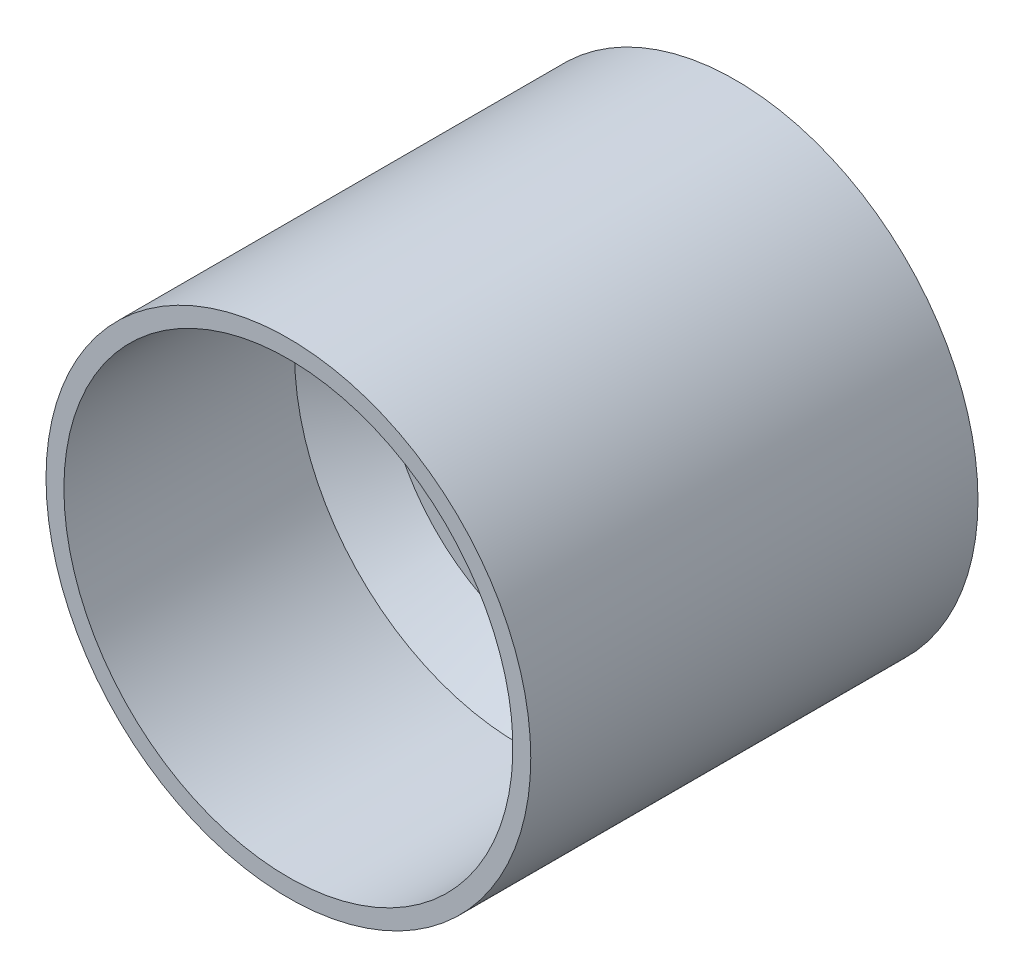
ISO-10303-21;
HEADER;
FILE_DESCRIPTION(('STEP AP214'),'2;1');
FILE_NAME('part.step','',(''),(''),'','','');
FILE_SCHEMA(('AUTOMOTIVE_DESIGN { 1 0 10303 214 1 1 1 1 }'));
ENDSEC;
DATA;
#1=APPLICATION_CONTEXT('core data for automotive mechanical design processes');
#2=APPLICATION_PROTOCOL_DEFINITION('international standard','automotive_design',2000,#1);
#3=PRODUCT_CONTEXT('',#1,'mechanical');
#4=PRODUCT('Part','Part','',(#3));
#5=PRODUCT_RELATED_PRODUCT_CATEGORY('part','',(#4));
#6=PRODUCT_DEFINITION_FORMATION('','',#4);
#7=PRODUCT_DEFINITION_CONTEXT('part definition',#1,'design');
#8=PRODUCT_DEFINITION('design','',#6,#7);
#9=PRODUCT_DEFINITION_SHAPE('','',#8);
#10=(LENGTH_UNIT() NAMED_UNIT(*) SI_UNIT(.MILLI.,.METRE.));
#11=(NAMED_UNIT(*) PLANE_ANGLE_UNIT() SI_UNIT($,.RADIAN.));
#12=(NAMED_UNIT(*) SI_UNIT($,.STERADIAN.) SOLID_ANGLE_UNIT());
#13=UNCERTAINTY_MEASURE_WITH_UNIT(LENGTH_MEASURE(1.E-05),#10,'distance_accuracy_value','');
#14=(GEOMETRIC_REPRESENTATION_CONTEXT(3) GLOBAL_UNCERTAINTY_ASSIGNED_CONTEXT((#13)) GLOBAL_UNIT_ASSIGNED_CONTEXT((#10,
#11,#12)) REPRESENTATION_CONTEXT('',''));
#15=CARTESIAN_POINT('',(0.,0.,0.));
#16=DIRECTION('',(0.,0.,1.));
#17=DIRECTION('',(1.,0.,0.));
#18=AXIS2_PLACEMENT_3D('',#15,#16,#17);
#19=CARTESIAN_POINT('',(25.1,0.,-10.3));
#20=DIRECTION('',(0.,0.,1.));
#21=DIRECTION('',(1.,0.,0.));
#22=AXIS2_PLACEMENT_3D('',#19,#20,#21);
#23=PLANE('',#22);
#24=CARTESIAN_POINT('',(0.,0.,-10.3));
#25=DIRECTION('',(0.,0.,1.));
#26=DIRECTION('',(1.,0.,0.));
#27=AXIS2_PLACEMENT_3D('',#24,#25,#26);
#28=CIRCLE('',#27,20.1);
#29=CARTESIAN_POINT('',(20.1,0.,-10.3));
#30=VERTEX_POINT('',#29);
#31=EDGE_CURVE('E203',#30,#30,#28,.F.);
#32=ORIENTED_EDGE('',*,*,#31,.T.);
#33=EDGE_LOOP('',(#32));
#34=FACE_BOUND('',#33,.T.);
#35=CARTESIAN_POINT('',(0.,-12.5,-10.3));
#36=DIRECTION('',(0.,0.,-1.));
#37=DIRECTION('',(-1.,0.,0.));
#38=AXIS2_PLACEMENT_3D('',#35,#36,#37);
#39=CIRCLE('',#38,1.5);
#40=CARTESIAN_POINT('',(-1.50000000000001,-12.5,-10.3));
#41=VERTEX_POINT('',#40);
#42=EDGE_CURVE('E457',#41,#41,#39,.T.);
#43=ORIENTED_EDGE('',*,*,#42,.F.);
#44=EDGE_LOOP('',(#43));
#45=FACE_BOUND('',#44,.T.);
#46=CARTESIAN_POINT('',(0.,12.5,-10.3));
#47=DIRECTION('',(0.,0.,-1.));
#48=DIRECTION('',(-1.,0.,0.));
#49=AXIS2_PLACEMENT_3D('',#46,#47,#48);
#50=CIRCLE('',#49,1.5);
#51=CARTESIAN_POINT('',(-1.5,12.5,-10.3));
#52=VERTEX_POINT('',#51);
#53=EDGE_CURVE('E465',#52,#52,#50,.T.);
#54=ORIENTED_EDGE('',*,*,#53,.F.);
#55=EDGE_LOOP('',(#54));
#56=FACE_BOUND('',#55,.T.);
#57=CARTESIAN_POINT('',(6.36396103067893,-6.36396103067893,-10.3));
#58=DIRECTION('',(0.,0.,-1.));
#59=DIRECTION('',(-1.,0.,0.));
#60=AXIS2_PLACEMENT_3D('',#57,#58,#59);
#61=CIRCLE('',#60,1.09999999999997);
#62=CARTESIAN_POINT('',(5.26396103067896,-6.36396103067893,-10.3));
#63=VERTEX_POINT('',#62);
#64=EDGE_CURVE('E462',#63,#63,#61,.T.);
#65=ORIENTED_EDGE('',*,*,#64,.F.);
#66=EDGE_LOOP('',(#65));
#67=FACE_BOUND('',#66,.T.);
#68=CARTESIAN_POINT('',(-6.36396103067893,-6.36396103067893,-10.3));
#69=DIRECTION('',(0.,0.,-1.));
#70=DIRECTION('',(-1.,0.,0.));
#71=AXIS2_PLACEMENT_3D('',#68,#69,#70);
#72=CIRCLE('',#71,1.09999999999994);
#73=CARTESIAN_POINT('',(-7.46396103067887,-6.36396103067893,-10.3));
#74=VERTEX_POINT('',#73);
#75=EDGE_CURVE('E454',#74,#74,#72,.T.);
#76=ORIENTED_EDGE('',*,*,#75,.F.);
#77=EDGE_LOOP('',(#76));
#78=FACE_BOUND('',#77,.T.);
#79=CARTESIAN_POINT('',(-6.36396103067893,6.36396103067893,-10.3));
#80=DIRECTION('',(0.,0.,-1.));
#81=DIRECTION('',(-1.,0.,0.));
#82=AXIS2_PLACEMENT_3D('',#79,#80,#81);
#83=CIRCLE('',#82,1.10000000000003);
#84=CARTESIAN_POINT('',(-7.46396103067896,6.36396103067893,-10.3));
#85=VERTEX_POINT('',#84);
#86=EDGE_CURVE('E450',#85,#85,#83,.T.);
#87=ORIENTED_EDGE('',*,*,#86,.F.);
#88=EDGE_LOOP('',(#87));
#89=FACE_BOUND('',#88,.T.);
#90=CARTESIAN_POINT('',(6.36396103067893,6.36396103067893,-10.3));
#91=DIRECTION('',(0.,0.,-1.));
#92=DIRECTION('',(-1.,0.,0.));
#93=AXIS2_PLACEMENT_3D('',#90,#91,#92);
#94=CIRCLE('',#93,1.10000000000006);
#95=CARTESIAN_POINT('',(5.26396103067887,6.36396103067893,-10.3));
#96=VERTEX_POINT('',#95);
#97=EDGE_CURVE('E106',#96,#96,#94,.T.);
#98=ORIENTED_EDGE('',*,*,#97,.F.);
#99=EDGE_LOOP('',(#98));
#100=FACE_BOUND('',#99,.T.);
#101=CARTESIAN_POINT('',(0.,0.,-10.3));
#102=DIRECTION('',(0.,0.,-1.));
#103=DIRECTION('',(-1.,0.,0.));
#104=AXIS2_PLACEMENT_3D('',#101,#102,#103);
#105=CIRCLE('',#104,7.05);
#106=CARTESIAN_POINT('',(-6.05,3.61939221417077,-10.3));
#107=VERTEX_POINT('',#106);
#108=CARTESIAN_POINT('',(6.05,3.61939221417077,-10.3));
#109=VERTEX_POINT('',#108);
#110=EDGE_CURVE('E98',#107,#109,#105,.T.);
#111=ORIENTED_EDGE('',*,*,#110,.F.);
#112=DIRECTION('',(0.,1.,0.));
#113=VECTOR('',#112,1.);
#114=CARTESIAN_POINT('',(-6.05,-3.61939221417077,-10.3));
#115=LINE('',#114,#113);
#116=CARTESIAN_POINT('',(-6.05,-3.61939221417077,-10.3));
#117=VERTEX_POINT('',#116);
#118=EDGE_CURVE('E95',#117,#107,#115,.T.);
#119=ORIENTED_EDGE('',*,*,#118,.F.);
#120=CARTESIAN_POINT('',(0.,0.,-10.3));
#121=DIRECTION('',(0.,0.,-1.));
#122=DIRECTION('',(-1.,0.,0.));
#123=AXIS2_PLACEMENT_3D('',#120,#121,#122);
#124=CIRCLE('',#123,7.05);
#125=CARTESIAN_POINT('',(6.05,-3.61939221417077,-10.3));
#126=VERTEX_POINT('',#125);
#127=EDGE_CURVE('E68',#126,#117,#124,.T.);
#128=ORIENTED_EDGE('',*,*,#127,.F.);
#129=DIRECTION('',(0.,-1.,0.));
#130=VECTOR('',#129,1.);
#131=CARTESIAN_POINT('',(6.05,3.61939221417077,-10.3));
#132=LINE('',#131,#130);
#133=EDGE_CURVE('E90',#109,#126,#132,.T.);
#134=ORIENTED_EDGE('',*,*,#133,.F.);
#135=EDGE_LOOP('',(#111,#119,#128,#134));
#136=FACE_BOUND('',#135,.T.);
#137=ADVANCED_FACE('F44',(#34,#45,#56,#67,#78,#89,#100,#136),#23,.F.);
#138=CARTESIAN_POINT('',(0.,0.,-51.2881578947369));
#139=DIRECTION('',(0.,0.,-1.));
#140=DIRECTION('',(-1.,0.,0.));
#141=AXIS2_PLACEMENT_3D('',#138,#139,#140);
#142=CYLINDRICAL_SURFACE('',#141,25.1);
#143=CARTESIAN_POINT('',(0.,0.,-15.3));
#144=DIRECTION('',(0.,0.,1.));
#145=DIRECTION('',(1.,0.,0.));
#146=AXIS2_PLACEMENT_3D('',#143,#144,#145);
#147=CIRCLE('',#146,25.1);
#148=CARTESIAN_POINT('',(25.1,0.,-15.3));
#149=VERTEX_POINT('',#148);
#150=EDGE_CURVE('E207',#149,#149,#147,.T.);
#151=ORIENTED_EDGE('',*,*,#150,.T.);
#152=EDGE_LOOP('',(#151));
#153=FACE_BOUND('',#152,.T.);
#154=CARTESIAN_POINT('',(0.,0.,-23.5));
#155=DIRECTION('',(0.,0.,-1.));
#156=DIRECTION('',(-1.,0.,0.));
#157=AXIS2_PLACEMENT_3D('',#154,#155,#156);
#158=CIRCLE('',#157,25.1);
#159=CARTESIAN_POINT('',(-25.1,0.,-23.5));
#160=VERTEX_POINT('',#159);
#161=EDGE_CURVE('E173',#160,#160,#158,.T.);
#162=ORIENTED_EDGE('',*,*,#161,.T.);
#163=EDGE_LOOP('',(#162));
#164=FACE_BOUND('',#163,.T.);
#165=ADVANCED_FACE('F233',(#153,#164),#142,.F.);
#166=CARTESIAN_POINT('',(0.,0.,-2.3));
#167=DIRECTION('',(0.,0.,-1.));
#168=DIRECTION('',(-1.,0.,0.));
#169=AXIS2_PLACEMENT_3D('',#166,#167,#168);
#170=CIRCLE('',#169,25.1);
#171=CARTESIAN_POINT('',(-25.1,0.,-2.3));
#172=VERTEX_POINT('',#171);
#173=EDGE_CURVE('E199',#172,#172,#170,.T.);
#174=ORIENTED_EDGE('',*,*,#173,.T.);
#175=EDGE_LOOP('',(#174));
#176=FACE_BOUND('',#175,.T.);
#177=CARTESIAN_POINT('',(0.,0.,23.5));
#178=DIRECTION('',(0.,0.,-1.));
#179=DIRECTION('',(-1.,0.,0.));
#180=AXIS2_PLACEMENT_3D('',#177,#178,#179);
#181=CIRCLE('',#180,25.1);
#182=CARTESIAN_POINT('',(-25.1,0.,23.5));
#183=VERTEX_POINT('',#182);
#184=EDGE_CURVE('E169',#183,#183,#181,.T.);
#185=ORIENTED_EDGE('',*,*,#184,.F.);
#186=EDGE_LOOP('',(#185));
#187=FACE_BOUND('',#186,.T.);
#188=ADVANCED_FACE('F239',(#176,#187),#142,.F.);
#189=CARTESIAN_POINT('',(27.1,0.,-26.5));
#190=DIRECTION('',(0.,0.,1.));
#191=DIRECTION('',(1.,0.,0.));
#192=AXIS2_PLACEMENT_3D('',#189,#190,#191);
#193=PLANE('',#192);
#194=CARTESIAN_POINT('',(0.,20.25,-26.5));
#195=DIRECTION('',(0.,0.,-1.));
#196=DIRECTION('',(-1.,0.,0.));
#197=AXIS2_PLACEMENT_3D('',#194,#195,#196);
#198=CIRCLE('',#197,2.);
#199=CARTESIAN_POINT('',(-2.,20.25,-26.5));
#200=VERTEX_POINT('',#199);
#201=EDGE_CURVE('E148',#200,#200,#198,.T.);
#202=ORIENTED_EDGE('',*,*,#201,.F.);
#203=EDGE_LOOP('',(#202));
#204=FACE_BOUND('',#203,.T.);
#205=CARTESIAN_POINT('',(17.5370144266349,-10.125,-26.5));
#206=DIRECTION('',(0.,0.,-1.));
#207=DIRECTION('',(-1.,0.,0.));
#208=AXIS2_PLACEMENT_3D('',#205,#206,#207);
#209=CIRCLE('',#208,2.);
#210=CARTESIAN_POINT('',(15.5370144266349,-10.125,-26.5));
#211=VERTEX_POINT('',#210);
#212=EDGE_CURVE('E153',#211,#211,#209,.T.);
#213=ORIENTED_EDGE('',*,*,#212,.F.);
#214=EDGE_LOOP('',(#213));
#215=FACE_BOUND('',#214,.T.);
#216=CARTESIAN_POINT('',(-17.5370144266349,-10.125,-26.5));
#217=DIRECTION('',(0.,0.,-1.));
#218=DIRECTION('',(-1.,0.,0.));
#219=AXIS2_PLACEMENT_3D('',#216,#217,#218);
#220=CIRCLE('',#219,2.);
#221=CARTESIAN_POINT('',(-19.5370144266349,-10.125,-26.5));
#222=VERTEX_POINT('',#221);
#223=EDGE_CURVE('E147',#222,#222,#220,.T.);
#224=ORIENTED_EDGE('',*,*,#223,.F.);
#225=EDGE_LOOP('',(#224));
#226=FACE_BOUND('',#225,.T.);
#227=CARTESIAN_POINT('',(0.,0.,-26.5));
#228=DIRECTION('',(0.,0.,-1.));
#229=DIRECTION('',(-1.,0.,0.));
#230=AXIS2_PLACEMENT_3D('',#227,#228,#229);
#231=CIRCLE('',#230,15.25);
#232=CARTESIAN_POINT('',(-15.25,0.,-26.5));
#233=VERTEX_POINT('',#232);
#234=EDGE_CURVE('E181',#233,#233,#231,.T.);
#235=ORIENTED_EDGE('',*,*,#234,.F.);
#236=EDGE_LOOP('',(#235));
#237=FACE_BOUND('',#236,.T.);
#238=CARTESIAN_POINT('',(0.,0.,-26.5));
#239=DIRECTION('',(0.,0.,-1.));
#240=DIRECTION('',(-1.,0.,0.));
#241=AXIS2_PLACEMENT_3D('',#238,#239,#240);
#242=CIRCLE('',#241,27.1);
#243=CARTESIAN_POINT('',(-27.1,0.,-26.5));
#244=VERTEX_POINT('',#243);
#245=EDGE_CURVE('E160',#244,#244,#242,.T.);
#246=ORIENTED_EDGE('',*,*,#245,.T.);
#247=EDGE_LOOP('',(#246));
#248=FACE_BOUND('',#247,.T.);
#249=ADVANCED_FACE('F273',(#204,#215,#226,#237,#248),#193,.F.);
#250=CARTESIAN_POINT('',(0.,0.,-51.2881578947369));
#251=DIRECTION('',(0.,0.,-1.));
#252=DIRECTION('',(-1.,0.,0.));
#253=AXIS2_PLACEMENT_3D('',#250,#251,#252);
#254=CYLINDRICAL_SURFACE('',#253,15.25);
#255=CARTESIAN_POINT('',(0.,0.,-23.5));
#256=DIRECTION('',(0.,0.,-1.));
#257=DIRECTION('',(-1.,0.,0.));
#258=AXIS2_PLACEMENT_3D('',#255,#256,#257);
#259=CIRCLE('',#258,15.25);
#260=CARTESIAN_POINT('',(-15.25,0.,-23.5));
#261=VERTEX_POINT('',#260);
#262=EDGE_CURVE('E177',#261,#261,#259,.T.);
#263=ORIENTED_EDGE('',*,*,#262,.F.);
#264=EDGE_LOOP('',(#263));
#265=FACE_BOUND('',#264,.T.);
#266=ORIENTED_EDGE('',*,*,#234,.T.);
#267=EDGE_LOOP('',(#266));
#268=FACE_BOUND('',#267,.T.);
#269=ADVANCED_FACE('F269',(#265,#268),#254,.F.);
#270=CARTESIAN_POINT('',(15.25,0.,-23.5));
#271=DIRECTION('',(0.,0.,-1.));
#272=DIRECTION('',(-1.,0.,0.));
#273=AXIS2_PLACEMENT_3D('',#270,#271,#272);
#274=PLANE('',#273);
#275=CARTESIAN_POINT('',(0.,20.25,-23.5));
#276=DIRECTION('',(0.,0.,-1.));
#277=DIRECTION('',(-1.,0.,0.));
#278=AXIS2_PLACEMENT_3D('',#275,#276,#277);
#279=CIRCLE('',#278,2.);
#280=CARTESIAN_POINT('',(-2.,20.25,-23.5));
#281=VERTEX_POINT('',#280);
#282=EDGE_CURVE('E165',#281,#281,#279,.T.);
#283=ORIENTED_EDGE('',*,*,#282,.T.);
#284=EDGE_LOOP('',(#283));
#285=FACE_BOUND('',#284,.T.);
#286=CARTESIAN_POINT('',(17.5370144266349,-10.125,-23.5));
#287=DIRECTION('',(0.,0.,-1.));
#288=DIRECTION('',(-1.,0.,0.));
#289=AXIS2_PLACEMENT_3D('',#286,#287,#288);
#290=CIRCLE('',#289,2.);
#291=CARTESIAN_POINT('',(15.5370144266349,-10.125,-23.5));
#292=VERTEX_POINT('',#291);
#293=EDGE_CURVE('E189',#292,#292,#290,.T.);
#294=ORIENTED_EDGE('',*,*,#293,.T.);
#295=EDGE_LOOP('',(#294));
#296=FACE_BOUND('',#295,.T.);
#297=CARTESIAN_POINT('',(-17.5370144266349,-10.125,-23.5));
#298=DIRECTION('',(0.,0.,-1.));
#299=DIRECTION('',(-1.,0.,0.));
#300=AXIS2_PLACEMENT_3D('',#297,#298,#299);
#301=CIRCLE('',#300,2.);
#302=CARTESIAN_POINT('',(-19.5370144266349,-10.125,-23.5));
#303=VERTEX_POINT('',#302);
#304=EDGE_CURVE('E152',#303,#303,#301,.T.);
#305=ORIENTED_EDGE('',*,*,#304,.T.);
#306=EDGE_LOOP('',(#305));
#307=FACE_BOUND('',#306,.T.);
#308=ORIENTED_EDGE('',*,*,#161,.F.);
#309=EDGE_LOOP('',(#308));
#310=FACE_BOUND('',#309,.T.);
#311=ORIENTED_EDGE('',*,*,#262,.T.);
#312=EDGE_LOOP('',(#311));
#313=FACE_BOUND('',#312,.T.);
#314=ADVANCED_FACE('F264',(#285,#296,#307,#310,#313),#274,.F.);
#315=CARTESIAN_POINT('',(25.1,0.,23.5));
#316=DIRECTION('',(0.,0.,-1.));
#317=DIRECTION('',(-1.,0.,0.));
#318=AXIS2_PLACEMENT_3D('',#315,#316,#317);
#319=PLANE('',#318);
#320=CARTESIAN_POINT('',(0.,0.,23.5));
#321=DIRECTION('',(0.,0.,-1.));
#322=DIRECTION('',(-1.,0.,0.));
#323=AXIS2_PLACEMENT_3D('',#320,#321,#322);
#324=CIRCLE('',#323,27.1);
#325=CARTESIAN_POINT('',(-27.1,0.,23.5));
#326=VERTEX_POINT('',#325);
#327=EDGE_CURVE('E164',#326,#326,#324,.T.);
#328=ORIENTED_EDGE('',*,*,#327,.F.);
#329=EDGE_LOOP('',(#328));
#330=FACE_BOUND('',#329,.T.);
#331=ORIENTED_EDGE('',*,*,#184,.T.);
#332=EDGE_LOOP('',(#331));
#333=FACE_BOUND('',#332,.T.);
#334=ADVANCED_FACE('F261',(#330,#333),#319,.F.);
#335=CARTESIAN_POINT('',(0.,0.,-51.2881578947369));
#336=DIRECTION('',(0.,0.,-1.));
#337=DIRECTION('',(-1.,0.,0.));
#338=AXIS2_PLACEMENT_3D('',#335,#336,#337);
#339=CYLINDRICAL_SURFACE('',#338,27.1);
#340=ORIENTED_EDGE('',*,*,#245,.F.);
#341=EDGE_LOOP('',(#340));
#342=FACE_BOUND('',#341,.T.);
#343=ORIENTED_EDGE('',*,*,#327,.T.);
#344=EDGE_LOOP('',(#343));
#345=FACE_BOUND('',#344,.T.);
#346=ADVANCED_FACE('F257',(#342,#345),#339,.T.);
#347=CARTESIAN_POINT('',(-17.5370144266349,-10.125,-16.5));
#348=DIRECTION('',(0.,0.,-1.));
#349=DIRECTION('',(-1.,0.,0.));
#350=AXIS2_PLACEMENT_3D('',#347,#348,#349);
#351=CYLINDRICAL_SURFACE('',#350,2.);
#352=ORIENTED_EDGE('',*,*,#223,.T.);
#353=EDGE_LOOP('',(#352));
#354=FACE_BOUND('',#353,.T.);
#355=ORIENTED_EDGE('',*,*,#304,.F.);
#356=EDGE_LOOP('',(#355));
#357=FACE_BOUND('',#356,.T.);
#358=ADVANCED_FACE('F253',(#354,#357),#351,.F.);
#359=CARTESIAN_POINT('',(17.5370144266349,-10.125,-16.5));
#360=DIRECTION('',(0.,0.,-1.));
#361=DIRECTION('',(-1.,0.,0.));
#362=AXIS2_PLACEMENT_3D('',#359,#360,#361);
#363=CYLINDRICAL_SURFACE('',#362,2.);
#364=ORIENTED_EDGE('',*,*,#212,.T.);
#365=EDGE_LOOP('',(#364));
#366=FACE_BOUND('',#365,.T.);
#367=ORIENTED_EDGE('',*,*,#293,.F.);
#368=EDGE_LOOP('',(#367));
#369=FACE_BOUND('',#368,.T.);
#370=ADVANCED_FACE('F249',(#366,#369),#363,.F.);
#371=CARTESIAN_POINT('',(0.,20.25,-16.5));
#372=DIRECTION('',(0.,0.,-1.));
#373=DIRECTION('',(-1.,0.,0.));
#374=AXIS2_PLACEMENT_3D('',#371,#372,#373);
#375=CYLINDRICAL_SURFACE('',#374,2.);
#376=ORIENTED_EDGE('',*,*,#201,.T.);
#377=EDGE_LOOP('',(#376));
#378=FACE_BOUND('',#377,.T.);
#379=ORIENTED_EDGE('',*,*,#282,.F.);
#380=EDGE_LOOP('',(#379));
#381=FACE_BOUND('',#380,.T.);
#382=ADVANCED_FACE('F246',(#378,#381),#375,.F.);
#383=CARTESIAN_POINT('',(0.,0.,-7.3));
#384=DIRECTION('',(0.,0.,-1.));
#385=DIRECTION('',(-1.,0.,0.));
#386=AXIS2_PLACEMENT_3D('',#383,#384,#385);
#387=PLANE('',#386);
#388=CARTESIAN_POINT('',(6.36396103067893,6.36396103067893,-7.3));
#389=DIRECTION('',(0.,0.,-1.));
#390=DIRECTION('',(-1.,0.,0.));
#391=AXIS2_PLACEMENT_3D('',#388,#389,#390);
#392=CIRCLE('',#391,1.10000000000006);
#393=CARTESIAN_POINT('',(5.26396103067887,6.36396103067893,-7.3));
#394=VERTEX_POINT('',#393);
#395=EDGE_CURVE('E143',#394,#394,#392,.T.);
#396=ORIENTED_EDGE('',*,*,#395,.T.);
#397=EDGE_LOOP('',(#396));
#398=FACE_BOUND('',#397,.T.);
#399=CARTESIAN_POINT('',(-6.36396103067893,6.36396103067893,-7.3));
#400=DIRECTION('',(0.,0.,-1.));
#401=DIRECTION('',(-1.,0.,0.));
#402=AXIS2_PLACEMENT_3D('',#399,#400,#401);
#403=CIRCLE('',#402,1.10000000000003);
#404=CARTESIAN_POINT('',(-7.46396103067896,6.36396103067893,-7.3));
#405=VERTEX_POINT('',#404);
#406=EDGE_CURVE('E139',#405,#405,#403,.T.);
#407=ORIENTED_EDGE('',*,*,#406,.T.);
#408=EDGE_LOOP('',(#407));
#409=FACE_BOUND('',#408,.T.);
#410=CARTESIAN_POINT('',(-6.36396103067893,-6.36396103067893,-7.3));
#411=DIRECTION('',(0.,0.,-1.));
#412=DIRECTION('',(-1.,0.,0.));
#413=AXIS2_PLACEMENT_3D('',#410,#411,#412);
#414=CIRCLE('',#413,1.09999999999994);
#415=CARTESIAN_POINT('',(-7.46396103067887,-6.36396103067893,-7.3));
#416=VERTEX_POINT('',#415);
#417=EDGE_CURVE('E135',#416,#416,#414,.T.);
#418=ORIENTED_EDGE('',*,*,#417,.T.);
#419=EDGE_LOOP('',(#418));
#420=FACE_BOUND('',#419,.T.);
#421=CARTESIAN_POINT('',(6.36396103067893,-6.36396103067893,-7.3));
#422=DIRECTION('',(0.,0.,-1.));
#423=DIRECTION('',(-1.,0.,0.));
#424=AXIS2_PLACEMENT_3D('',#421,#422,#423);
#425=CIRCLE('',#424,1.09999999999997);
#426=CARTESIAN_POINT('',(5.26396103067896,-6.36396103067893,-7.3));
#427=VERTEX_POINT('',#426);
#428=EDGE_CURVE('E131',#427,#427,#425,.T.);
#429=ORIENTED_EDGE('',*,*,#428,.T.);
#430=EDGE_LOOP('',(#429));
#431=FACE_BOUND('',#430,.T.);
#432=CARTESIAN_POINT('',(0.,12.5,-7.3));
#433=DIRECTION('',(0.,0.,-1.));
#434=DIRECTION('',(-1.,0.,0.));
#435=AXIS2_PLACEMENT_3D('',#432,#433,#434);
#436=CIRCLE('',#435,1.5);
#437=CARTESIAN_POINT('',(-1.5,12.5,-7.3));
#438=VERTEX_POINT('',#437);
#439=EDGE_CURVE('E127',#438,#438,#436,.T.);
#440=ORIENTED_EDGE('',*,*,#439,.T.);
#441=EDGE_LOOP('',(#440));
#442=FACE_BOUND('',#441,.T.);
#443=CARTESIAN_POINT('',(0.,-12.5,-7.3));
#444=DIRECTION('',(0.,0.,-1.));
#445=DIRECTION('',(-1.,0.,0.));
#446=AXIS2_PLACEMENT_3D('',#443,#444,#445);
#447=CIRCLE('',#446,1.5);
#448=CARTESIAN_POINT('',(-1.50000000000001,-12.5,-7.3));
#449=VERTEX_POINT('',#448);
#450=EDGE_CURVE('E118',#449,#449,#447,.T.);
#451=ORIENTED_EDGE('',*,*,#450,.T.);
#452=EDGE_LOOP('',(#451));
#453=FACE_BOUND('',#452,.T.);
#454=DIRECTION('',(0.,1.,0.));
#455=VECTOR('',#454,1.);
#456=CARTESIAN_POINT('',(-6.05,0.,-7.3));
#457=LINE('',#456,#455);
#458=CARTESIAN_POINT('',(-6.05,-3.61939221417077,-7.3));
#459=VERTEX_POINT('',#458);
#460=CARTESIAN_POINT('',(-6.05,3.61939221417077,-7.3));
#461=VERTEX_POINT('',#460);
#462=EDGE_CURVE('E54',#459,#461,#457,.T.);
#463=ORIENTED_EDGE('',*,*,#462,.T.);
#464=CARTESIAN_POINT('',(0.,0.,-7.3));
#465=DIRECTION('',(0.,0.,-1.));
#466=DIRECTION('',(-1.,0.,0.));
#467=AXIS2_PLACEMENT_3D('',#464,#465,#466);
#468=CIRCLE('',#467,7.05);
#469=CARTESIAN_POINT('',(6.05,3.61939221417077,-7.3));
#470=VERTEX_POINT('',#469);
#471=EDGE_CURVE('E11',#461,#470,#468,.T.);
#472=ORIENTED_EDGE('',*,*,#471,.T.);
#473=DIRECTION('',(0.,-1.,0.));
#474=VECTOR('',#473,1.);
#475=CARTESIAN_POINT('',(6.05,0.,-7.3));
#476=LINE('',#475,#474);
#477=CARTESIAN_POINT('',(6.05,-3.61939221417077,-7.3));
#478=VERTEX_POINT('',#477);
#479=EDGE_CURVE('E92',#470,#478,#476,.T.);
#480=ORIENTED_EDGE('',*,*,#479,.T.);
#481=CARTESIAN_POINT('',(0.,0.,-7.3));
#482=DIRECTION('',(0.,0.,-1.));
#483=DIRECTION('',(-1.,0.,0.));
#484=AXIS2_PLACEMENT_3D('',#481,#482,#483);
#485=CIRCLE('',#484,7.05);
#486=EDGE_CURVE('E213',#478,#459,#485,.T.);
#487=ORIENTED_EDGE('',*,*,#486,.T.);
#488=EDGE_LOOP('',(#463,#472,#480,#487));
#489=FACE_BOUND('',#488,.T.);
#490=CARTESIAN_POINT('',(0.,0.,-7.3));
#491=DIRECTION('',(0.,0.,-1.));
#492=DIRECTION('',(-1.,0.,0.));
#493=AXIS2_PLACEMENT_3D('',#490,#491,#492);
#494=CIRCLE('',#493,20.1);
#495=CARTESIAN_POINT('',(-20.1,0.,-7.3));
#496=VERTEX_POINT('',#495);
#497=EDGE_CURVE('E185',#496,#496,#494,.F.);
#498=ORIENTED_EDGE('',*,*,#497,.T.);
#499=EDGE_LOOP('',(#498));
#500=FACE_BOUND('',#499,.T.);
#501=ADVANCED_FACE('F219',(#398,#409,#420,#431,#442,#453,#489,#500),#387,.F.);
#502=CARTESIAN_POINT('',(0.,0.,-7.3));
#503=DIRECTION('',(0.,0.,1.));
#504=DIRECTION('',(1.,0.,0.));
#505=AXIS2_PLACEMENT_3D('',#502,#503,#504);
#506=CONICAL_SURFACE('',#505,20.1,0.785398163397453);
#507=ORIENTED_EDGE('',*,*,#173,.F.);
#508=EDGE_LOOP('',(#507));
#509=FACE_BOUND('',#508,.T.);
#510=ORIENTED_EDGE('',*,*,#497,.F.);
#511=EDGE_LOOP('',(#510));
#512=FACE_BOUND('',#511,.T.);
#513=ADVANCED_FACE('F278',(#509,#512),#506,.F.);
#514=CARTESIAN_POINT('',(0.,0.,-10.3));
#515=DIRECTION('',(0.,0.,-1.));
#516=DIRECTION('',(-1.,0.,0.));
#517=AXIS2_PLACEMENT_3D('',#514,#515,#516);
#518=CONICAL_SURFACE('',#517,20.1,0.785398163397454);
#519=ORIENTED_EDGE('',*,*,#150,.F.);
#520=EDGE_LOOP('',(#519));
#521=FACE_BOUND('',#520,.T.);
#522=ORIENTED_EDGE('',*,*,#31,.F.);
#523=EDGE_LOOP('',(#522));
#524=FACE_BOUND('',#523,.T.);
#525=ADVANCED_FACE('F47',(#521,#524),#518,.F.);
#526=CARTESIAN_POINT('',(0.,-12.5,-0.300000000000002));
#527=DIRECTION('',(0.,0.,-1.));
#528=DIRECTION('',(-1.,0.,0.));
#529=AXIS2_PLACEMENT_3D('',#526,#527,#528);
#530=CYLINDRICAL_SURFACE('',#529,1.5);
#531=ORIENTED_EDGE('',*,*,#42,.T.);
#532=EDGE_LOOP('',(#531));
#533=FACE_BOUND('',#532,.T.);
#534=ORIENTED_EDGE('',*,*,#450,.F.);
#535=EDGE_LOOP('',(#534));
#536=FACE_BOUND('',#535,.T.);
#537=ADVANCED_FACE('F287',(#533,#536),#530,.F.);
#538=CARTESIAN_POINT('',(0.,12.5,-0.300000000000002));
#539=DIRECTION('',(0.,0.,-1.));
#540=DIRECTION('',(-1.,0.,0.));
#541=AXIS2_PLACEMENT_3D('',#538,#539,#540);
#542=CYLINDRICAL_SURFACE('',#541,1.5);
#543=ORIENTED_EDGE('',*,*,#53,.T.);
#544=EDGE_LOOP('',(#543));
#545=FACE_BOUND('',#544,.T.);
#546=ORIENTED_EDGE('',*,*,#439,.F.);
#547=EDGE_LOOP('',(#546));
#548=FACE_BOUND('',#547,.T.);
#549=ADVANCED_FACE('F352',(#545,#548),#542,.F.);
#550=CARTESIAN_POINT('',(6.36396103067893,-6.36396103067893,-0.300000000000002));
#551=DIRECTION('',(0.,0.,-1.));
#552=DIRECTION('',(-1.,0.,0.));
#553=AXIS2_PLACEMENT_3D('',#550,#551,#552);
#554=CYLINDRICAL_SURFACE('',#553,1.09999999999997);
#555=ORIENTED_EDGE('',*,*,#64,.T.);
#556=EDGE_LOOP('',(#555));
#557=FACE_BOUND('',#556,.T.);
#558=ORIENTED_EDGE('',*,*,#428,.F.);
#559=EDGE_LOOP('',(#558));
#560=FACE_BOUND('',#559,.T.);
#561=ADVANCED_FACE('F362',(#557,#560),#554,.F.);
#562=CARTESIAN_POINT('',(-6.36396103067893,-6.36396103067893,-0.300000000000002));
#563=DIRECTION('',(0.,0.,-1.));
#564=DIRECTION('',(-1.,0.,0.));
#565=AXIS2_PLACEMENT_3D('',#562,#563,#564);
#566=CYLINDRICAL_SURFACE('',#565,1.09999999999994);
#567=ORIENTED_EDGE('',*,*,#75,.T.);
#568=EDGE_LOOP('',(#567));
#569=FACE_BOUND('',#568,.T.);
#570=ORIENTED_EDGE('',*,*,#417,.F.);
#571=EDGE_LOOP('',(#570));
#572=FACE_BOUND('',#571,.T.);
#573=ADVANCED_FACE('F372',(#569,#572),#566,.F.);
#574=CARTESIAN_POINT('',(-6.36396103067893,6.36396103067893,-0.300000000000002));
#575=DIRECTION('',(0.,0.,-1.));
#576=DIRECTION('',(-1.,0.,0.));
#577=AXIS2_PLACEMENT_3D('',#574,#575,#576);
#578=CYLINDRICAL_SURFACE('',#577,1.10000000000003);
#579=ORIENTED_EDGE('',*,*,#86,.T.);
#580=EDGE_LOOP('',(#579));
#581=FACE_BOUND('',#580,.T.);
#582=ORIENTED_EDGE('',*,*,#406,.F.);
#583=EDGE_LOOP('',(#582));
#584=FACE_BOUND('',#583,.T.);
#585=ADVANCED_FACE('F382',(#581,#584),#578,.F.);
#586=CARTESIAN_POINT('',(6.36396103067893,6.36396103067893,-0.300000000000002));
#587=DIRECTION('',(0.,0.,-1.));
#588=DIRECTION('',(-1.,0.,0.));
#589=AXIS2_PLACEMENT_3D('',#586,#587,#588);
#590=CYLINDRICAL_SURFACE('',#589,1.10000000000006);
#591=ORIENTED_EDGE('',*,*,#97,.T.);
#592=EDGE_LOOP('',(#591));
#593=FACE_BOUND('',#592,.T.);
#594=ORIENTED_EDGE('',*,*,#395,.F.);
#595=EDGE_LOOP('',(#594));
#596=FACE_BOUND('',#595,.T.);
#597=ADVANCED_FACE('F392',(#593,#596),#590,.F.);
#598=CARTESIAN_POINT('',(0.,0.,-0.300000000000002));
#599=DIRECTION('',(0.,0.,-1.));
#600=DIRECTION('',(-1.,0.,0.));
#601=AXIS2_PLACEMENT_3D('',#598,#599,#600);
#602=CYLINDRICAL_SURFACE('',#601,7.05);
#603=DIRECTION('',(0.,0.,-1.));
#604=VECTOR('',#603,1.);
#605=CARTESIAN_POINT('',(-6.05,3.61939221417077,-0.300000000000002));
#606=LINE('',#605,#604);
#607=EDGE_CURVE('E101',#461,#107,#606,.T.);
#608=ORIENTED_EDGE('',*,*,#607,.T.);
#609=ORIENTED_EDGE('',*,*,#110,.T.);
#610=DIRECTION('',(0.,0.,-1.));
#611=VECTOR('',#610,1.);
#612=CARTESIAN_POINT('',(6.05,3.61939221417077,-0.300000000000002));
#613=LINE('',#612,#611);
#614=EDGE_CURVE('E86',#470,#109,#613,.T.);
#615=ORIENTED_EDGE('',*,*,#614,.F.);
#616=ORIENTED_EDGE('',*,*,#471,.F.);
#617=EDGE_LOOP('',(#608,#609,#615,#616));
#618=FACE_BOUND('',#617,.T.);
#619=ADVANCED_FACE('F99',(#618),#602,.F.);
#620=CARTESIAN_POINT('',(-6.05,-3.61939221417077,-0.300000000000002));
#621=DIRECTION('',(-1.,0.,0.));
#622=DIRECTION('',(0.,0.,1.));
#623=AXIS2_PLACEMENT_3D('',#620,#621,#622);
#624=PLANE('',#623);
#625=DIRECTION('',(0.,0.,-1.));
#626=VECTOR('',#625,1.);
#627=CARTESIAN_POINT('',(-6.05,-3.61939221417077,-0.300000000000002));
#628=LINE('',#627,#626);
#629=EDGE_CURVE('E119',#459,#117,#628,.T.);
#630=ORIENTED_EDGE('',*,*,#629,.T.);
#631=ORIENTED_EDGE('',*,*,#118,.T.);
#632=ORIENTED_EDGE('',*,*,#607,.F.);
#633=ORIENTED_EDGE('',*,*,#462,.F.);
#634=EDGE_LOOP('',(#630,#631,#632,#633));
#635=FACE_BOUND('',#634,.T.);
#636=ADVANCED_FACE('F222',(#635),#624,.F.);
#637=CARTESIAN_POINT('',(0.,0.,-0.300000000000002));
#638=DIRECTION('',(0.,0.,-1.));
#639=DIRECTION('',(-1.,0.,0.));
#640=AXIS2_PLACEMENT_3D('',#637,#638,#639);
#641=CYLINDRICAL_SURFACE('',#640,7.05);
#642=DIRECTION('',(0.,0.,-1.));
#643=VECTOR('',#642,1.);
#644=CARTESIAN_POINT('',(6.05,-3.61939221417077,-0.300000000000002));
#645=LINE('',#644,#643);
#646=EDGE_CURVE('E61',#478,#126,#645,.T.);
#647=ORIENTED_EDGE('',*,*,#646,.T.);
#648=ORIENTED_EDGE('',*,*,#127,.T.);
#649=ORIENTED_EDGE('',*,*,#629,.F.);
#650=ORIENTED_EDGE('',*,*,#486,.F.);
#651=EDGE_LOOP('',(#647,#648,#649,#650));
#652=FACE_BOUND('',#651,.T.);
#653=ADVANCED_FACE('F223',(#652),#641,.F.);
#654=CARTESIAN_POINT('',(6.05,3.61939221417077,-0.300000000000002));
#655=DIRECTION('',(1.,0.,0.));
#656=DIRECTION('',(0.,0.,-1.));
#657=AXIS2_PLACEMENT_3D('',#654,#655,#656);
#658=PLANE('',#657);
#659=ORIENTED_EDGE('',*,*,#614,.T.);
#660=ORIENTED_EDGE('',*,*,#133,.T.);
#661=ORIENTED_EDGE('',*,*,#646,.F.);
#662=ORIENTED_EDGE('',*,*,#479,.F.);
#663=EDGE_LOOP('',(#659,#660,#661,#662));
#664=FACE_BOUND('',#663,.T.);
#665=ADVANCED_FACE('F88',(#664),#658,.F.);
#666=CLOSED_SHELL('',(#137,#165,#188,#249,#269,#314,#334,#346,#358,#370,#382,#501,#513,#525,
#537,#549,#561,#573,#585,#597,#619,#636,#653,#665));
#667=MANIFOLD_SOLID_BREP('B2',#666);
#668=ADVANCED_BREP_SHAPE_REPRESENTATION('',(#18,#667),#14);
#669=SHAPE_DEFINITION_REPRESENTATION(#9,#668);
ENDSEC;
END-ISO-10303-21;
